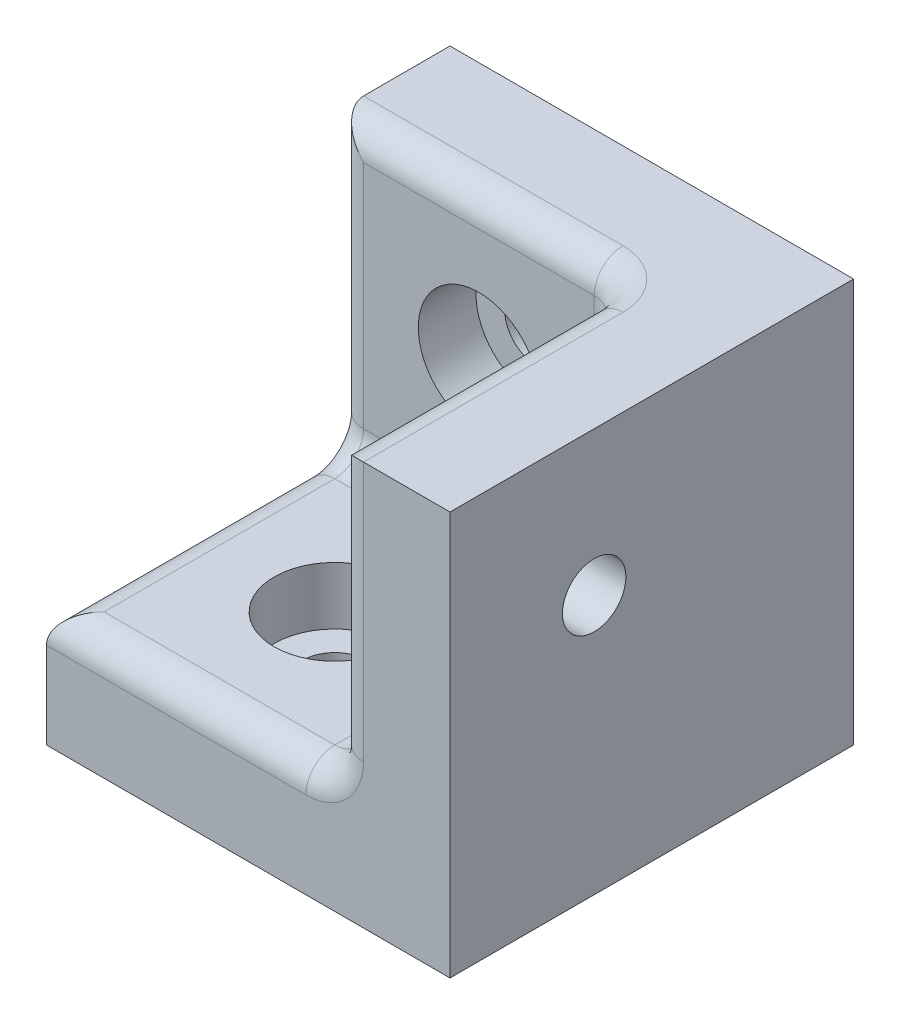
ISO-10303-21;
HEADER;
FILE_DESCRIPTION(('STEP AP214'),'2;1');
FILE_NAME('part.step','',(''),(''),'','','');
FILE_SCHEMA(('AUTOMOTIVE_DESIGN { 1 0 10303 214 1 1 1 1 }'));
ENDSEC;
DATA;
#1=APPLICATION_CONTEXT('core data for automotive mechanical design processes');
#2=APPLICATION_PROTOCOL_DEFINITION('international standard','automotive_design',2000,#1);
#3=PRODUCT_CONTEXT('',#1,'mechanical');
#4=PRODUCT('Part','Part','',(#3));
#5=PRODUCT_RELATED_PRODUCT_CATEGORY('part','',(#4));
#6=PRODUCT_DEFINITION_FORMATION('','',#4);
#7=PRODUCT_DEFINITION_CONTEXT('part definition',#1,'design');
#8=PRODUCT_DEFINITION('design','',#6,#7);
#9=PRODUCT_DEFINITION_SHAPE('','',#8);
#10=(LENGTH_UNIT() NAMED_UNIT(*) SI_UNIT(.MILLI.,.METRE.));
#11=(NAMED_UNIT(*) PLANE_ANGLE_UNIT() SI_UNIT($,.RADIAN.));
#12=(NAMED_UNIT(*) SI_UNIT($,.STERADIAN.) SOLID_ANGLE_UNIT());
#13=UNCERTAINTY_MEASURE_WITH_UNIT(LENGTH_MEASURE(1.E-05),#10,'distance_accuracy_value','');
#14=(GEOMETRIC_REPRESENTATION_CONTEXT(3) GLOBAL_UNCERTAINTY_ASSIGNED_CONTEXT((#13)) GLOBAL_UNIT_ASSIGNED_CONTEXT((#10,
#11,#12)) REPRESENTATION_CONTEXT('',''));
#15=CARTESIAN_POINT('',(0.,0.,0.));
#16=DIRECTION('',(0.,0.,1.));
#17=DIRECTION('',(1.,0.,0.));
#18=AXIS2_PLACEMENT_3D('',#15,#16,#17);
#19=CARTESIAN_POINT('',(9.,9.,9.));
#20=DIRECTION('',(-1.,0.,0.));
#21=DIRECTION('',(0.,0.,1.));
#22=AXIS2_PLACEMENT_3D('',#19,#20,#21);
#23=CYLINDRICAL_SURFACE('',#22,1.1);
#24=CARTESIAN_POINT('',(9.,9.,9.));
#25=DIRECTION('',(-1.,0.,0.));
#26=DIRECTION('',(0.,0.,1.));
#27=AXIS2_PLACEMENT_3D('',#24,#25,#26);
#28=CIRCLE('',#27,1.1);
#29=CARTESIAN_POINT('',(9.,9.,10.1));
#30=VERTEX_POINT('',#29);
#31=EDGE_CURVE('E164',#30,#30,#28,.T.);
#32=ORIENTED_EDGE('',*,*,#31,.F.);
#33=EDGE_LOOP('',(#32));
#34=FACE_BOUND('',#33,.T.);
#35=CARTESIAN_POINT('',(7.,9.,9.));
#36=DIRECTION('',(-1.,0.,0.));
#37=DIRECTION('',(0.,0.,1.));
#38=AXIS2_PLACEMENT_3D('',#35,#36,#37);
#39=CIRCLE('',#38,1.1);
#40=CARTESIAN_POINT('',(7.,9.,10.1));
#41=VERTEX_POINT('',#40);
#42=EDGE_CURVE('E167',#41,#41,#39,.F.);
#43=ORIENTED_EDGE('',*,*,#42,.F.);
#44=EDGE_LOOP('',(#43));
#45=FACE_BOUND('',#44,.T.);
#46=ADVANCED_FACE('F37',(#34,#45),#23,.F.);
#47=CARTESIAN_POINT('',(0.,0.,9.));
#48=DIRECTION('',(0.,1.,0.));
#49=DIRECTION('',(0.,0.,1.));
#50=AXIS2_PLACEMENT_3D('',#47,#48,#49);
#51=CYLINDRICAL_SURFACE('',#50,1.1);
#52=CARTESIAN_POINT('',(0.,0.,9.));
#53=DIRECTION('',(0.,1.,0.));
#54=DIRECTION('',(0.,0.,1.));
#55=AXIS2_PLACEMENT_3D('',#52,#53,#54);
#56=CIRCLE('',#55,1.1);
#57=CARTESIAN_POINT('',(0.,0.,10.1));
#58=VERTEX_POINT('',#57);
#59=EDGE_CURVE('E190',#58,#58,#56,.T.);
#60=ORIENTED_EDGE('',*,*,#59,.F.);
#61=EDGE_LOOP('',(#60));
#62=FACE_BOUND('',#61,.T.);
#63=CARTESIAN_POINT('',(0.,2.,9.));
#64=DIRECTION('',(0.,1.,0.));
#65=DIRECTION('',(0.,0.,1.));
#66=AXIS2_PLACEMENT_3D('',#63,#64,#65);
#67=CIRCLE('',#66,1.1);
#68=CARTESIAN_POINT('',(0.,2.,10.1));
#69=VERTEX_POINT('',#68);
#70=EDGE_CURVE('E180',#69,#69,#67,.F.);
#71=ORIENTED_EDGE('',*,*,#70,.F.);
#72=EDGE_LOOP('',(#71));
#73=FACE_BOUND('',#72,.T.);
#74=ADVANCED_FACE('F324',(#62,#73),#51,.F.);
#75=CARTESIAN_POINT('',(0.,9.,0.));
#76=DIRECTION('',(0.,0.,1.));
#77=DIRECTION('',(1.,0.,0.));
#78=AXIS2_PLACEMENT_3D('',#75,#76,#77);
#79=CYLINDRICAL_SURFACE('',#78,1.1);
#80=CARTESIAN_POINT('',(0.,9.,0.));
#81=DIRECTION('',(0.,0.,1.));
#82=DIRECTION('',(1.,0.,0.));
#83=AXIS2_PLACEMENT_3D('',#80,#81,#82);
#84=CIRCLE('',#83,1.1);
#85=CARTESIAN_POINT('',(1.1,9.,0.));
#86=VERTEX_POINT('',#85);
#87=EDGE_CURVE('E193',#86,#86,#84,.T.);
#88=ORIENTED_EDGE('',*,*,#87,.F.);
#89=EDGE_LOOP('',(#88));
#90=FACE_BOUND('',#89,.T.);
#91=CARTESIAN_POINT('',(0.,9.,2.));
#92=DIRECTION('',(0.,0.,1.));
#93=DIRECTION('',(1.,0.,0.));
#94=AXIS2_PLACEMENT_3D('',#91,#92,#93);
#95=CIRCLE('',#94,1.1);
#96=CARTESIAN_POINT('',(1.1,9.,2.));
#97=VERTEX_POINT('',#96);
#98=EDGE_CURVE('E186',#97,#97,#95,.F.);
#99=ORIENTED_EDGE('',*,*,#98,.F.);
#100=EDGE_LOOP('',(#99));
#101=FACE_BOUND('',#100,.T.);
#102=ADVANCED_FACE('F329',(#90,#101),#79,.F.);
#103=CARTESIAN_POINT('',(-5.,14.,4.));
#104=DIRECTION('',(1.,0.,0.));
#105=DIRECTION('',(0.,1.,0.));
#106=AXIS2_PLACEMENT_3D('',#103,#104,#105);
#107=PLANE('',#106);
#108=CARTESIAN_POINT('',(-5.,5.,5.));
#109=DIRECTION('',(1.,0.,0.));
#110=DIRECTION('',(0.,1.,0.));
#111=AXIS2_PLACEMENT_3D('',#108,#109,#110);
#112=CIRCLE('',#111,2.);
#113=CARTESIAN_POINT('',(-5.,5.,3.));
#114=VERTEX_POINT('',#113);
#115=CARTESIAN_POINT('',(-5.,3.,5.));
#116=VERTEX_POINT('',#115);
#117=EDGE_CURVE('E245',#114,#116,#112,.F.);
#118=ORIENTED_EDGE('',*,*,#117,.F.);
#119=DIRECTION('',(0.,-1.,0.));
#120=VECTOR('',#119,1.);
#121=CARTESIAN_POINT('',(-5.,14.,3.));
#122=LINE('',#121,#120);
#123=CARTESIAN_POINT('',(-5.,14.,3.));
#124=VERTEX_POINT('',#123);
#125=EDGE_CURVE('E250',#114,#124,#122,.F.);
#126=ORIENTED_EDGE('',*,*,#125,.T.);
#127=DIRECTION('',(0.,0.,-1.));
#128=VECTOR('',#127,1.);
#129=CARTESIAN_POINT('',(-5.,14.,4.));
#130=LINE('',#129,#128);
#131=CARTESIAN_POINT('',(-5.,14.,0.));
#132=VERTEX_POINT('',#131);
#133=EDGE_CURVE('E202',#124,#132,#130,.T.);
#134=ORIENTED_EDGE('',*,*,#133,.T.);
#135=DIRECTION('',(0.,-1.,0.));
#136=VECTOR('',#135,1.);
#137=CARTESIAN_POINT('',(-5.,14.,0.));
#138=LINE('',#137,#136);
#139=CARTESIAN_POINT('',(-5.,0.,0.));
#140=VERTEX_POINT('',#139);
#141=EDGE_CURVE('E150',#132,#140,#138,.T.);
#142=ORIENTED_EDGE('',*,*,#141,.T.);
#143=DIRECTION('',(0.,0.,-1.));
#144=VECTOR('',#143,1.);
#145=CARTESIAN_POINT('',(-5.,0.,4.));
#146=LINE('',#145,#144);
#147=CARTESIAN_POINT('',(-5.,0.,14.));
#148=VERTEX_POINT('',#147);
#149=EDGE_CURVE('E145',#148,#140,#146,.T.);
#150=ORIENTED_EDGE('',*,*,#149,.F.);
#151=DIRECTION('',(0.,-1.,0.));
#152=VECTOR('',#151,1.);
#153=CARTESIAN_POINT('',(-5.,0.,14.));
#154=LINE('',#153,#152);
#155=CARTESIAN_POINT('',(-5.,3.,14.));
#156=VERTEX_POINT('',#155);
#157=EDGE_CURVE('E196',#156,#148,#154,.T.);
#158=ORIENTED_EDGE('',*,*,#157,.F.);
#159=DIRECTION('',(0.,0.,-1.));
#160=VECTOR('',#159,1.);
#161=CARTESIAN_POINT('',(-5.,3.,4.));
#162=LINE('',#161,#160);
#163=EDGE_CURVE('E248',#156,#116,#162,.T.);
#164=ORIENTED_EDGE('',*,*,#163,.T.);
#165=EDGE_LOOP('',(#118,#126,#134,#142,#150,#158,#164));
#166=FACE_BOUND('',#165,.T.);
#167=ADVANCED_FACE('F360',(#166),#107,.F.);
#168=CARTESIAN_POINT('',(-5.,0.,4.));
#169=DIRECTION('',(0.,1.,0.));
#170=DIRECTION('',(0.,0.,1.));
#171=AXIS2_PLACEMENT_3D('',#168,#169,#170);
#172=PLANE('',#171);
#173=ORIENTED_EDGE('',*,*,#59,.T.);
#174=EDGE_LOOP('',(#173));
#175=FACE_BOUND('',#174,.T.);
#176=DIRECTION('',(1.,0.,0.));
#177=VECTOR('',#176,1.);
#178=CARTESIAN_POINT('',(-5.,0.,0.));
#179=LINE('',#178,#177);
#180=CARTESIAN_POINT('',(9.,0.,0.));
#181=VERTEX_POINT('',#180);
#182=EDGE_CURVE('E138',#140,#181,#179,.T.);
#183=ORIENTED_EDGE('',*,*,#182,.T.);
#184=DIRECTION('',(0.,0.,-1.));
#185=VECTOR('',#184,1.);
#186=CARTESIAN_POINT('',(9.,0.,14.));
#187=LINE('',#186,#185);
#188=CARTESIAN_POINT('',(9.,0.,14.));
#189=VERTEX_POINT('',#188);
#190=EDGE_CURVE('E143',#189,#181,#187,.T.);
#191=ORIENTED_EDGE('',*,*,#190,.F.);
#192=DIRECTION('',(1.,0.,0.));
#193=VECTOR('',#192,1.);
#194=CARTESIAN_POINT('',(-5.,0.,14.));
#195=LINE('',#194,#193);
#196=EDGE_CURVE('E198',#148,#189,#195,.T.);
#197=ORIENTED_EDGE('',*,*,#196,.F.);
#198=ORIENTED_EDGE('',*,*,#149,.T.);
#199=EDGE_LOOP('',(#183,#191,#197,#198));
#200=FACE_BOUND('',#199,.T.);
#201=ADVANCED_FACE('F140',(#175,#200),#172,.F.);
#202=CARTESIAN_POINT('',(-5.,14.,4.));
#203=DIRECTION('',(0.,-1.,0.));
#204=DIRECTION('',(0.,0.,-1.));
#205=AXIS2_PLACEMENT_3D('',#202,#203,#204);
#206=PLANE('',#205);
#207=CARTESIAN_POINT('',(4.,14.,5.));
#208=DIRECTION('',(0.,-1.,0.));
#209=DIRECTION('',(0.,0.,-1.));
#210=AXIS2_PLACEMENT_3D('',#207,#208,#209);
#211=CIRCLE('',#210,2.);
#212=CARTESIAN_POINT('',(6.,14.,5.));
#213=VERTEX_POINT('',#212);
#214=CARTESIAN_POINT('',(4.,14.,3.));
#215=VERTEX_POINT('',#214);
#216=EDGE_CURVE('E205',#213,#215,#211,.F.);
#217=ORIENTED_EDGE('',*,*,#216,.F.);
#218=DIRECTION('',(0.,0.,1.));
#219=VECTOR('',#218,1.);
#220=CARTESIAN_POINT('',(6.,14.,4.));
#221=LINE('',#220,#219);
#222=CARTESIAN_POINT('',(6.,14.,14.));
#223=VERTEX_POINT('',#222);
#224=EDGE_CURVE('E217',#213,#223,#221,.T.);
#225=ORIENTED_EDGE('',*,*,#224,.T.);
#226=DIRECTION('',(-1.,0.,0.));
#227=VECTOR('',#226,1.);
#228=CARTESIAN_POINT('',(9.,14.,14.));
#229=LINE('',#228,#227);
#230=CARTESIAN_POINT('',(9.,14.,14.));
#231=VERTEX_POINT('',#230);
#232=EDGE_CURVE('E173',#231,#223,#229,.T.);
#233=ORIENTED_EDGE('',*,*,#232,.F.);
#234=DIRECTION('',(0.,0.,1.));
#235=VECTOR('',#234,1.);
#236=CARTESIAN_POINT('',(9.,14.,0.));
#237=LINE('',#236,#235);
#238=CARTESIAN_POINT('',(9.,14.,0.));
#239=VERTEX_POINT('',#238);
#240=EDGE_CURVE('E158',#239,#231,#237,.T.);
#241=ORIENTED_EDGE('',*,*,#240,.F.);
#242=DIRECTION('',(-1.,0.,0.));
#243=VECTOR('',#242,1.);
#244=CARTESIAN_POINT('',(-5.,14.,0.));
#245=LINE('',#244,#243);
#246=EDGE_CURVE('E149',#239,#132,#245,.T.);
#247=ORIENTED_EDGE('',*,*,#246,.T.);
#248=ORIENTED_EDGE('',*,*,#133,.F.);
#249=DIRECTION('',(-1.,0.,0.));
#250=VECTOR('',#249,1.);
#251=CARTESIAN_POINT('',(5.,14.,3.));
#252=LINE('',#251,#250);
#253=EDGE_CURVE('E215',#124,#215,#252,.F.);
#254=ORIENTED_EDGE('',*,*,#253,.T.);
#255=EDGE_LOOP('',(#217,#225,#233,#241,#247,#248,#254));
#256=FACE_BOUND('',#255,.T.);
#257=ADVANCED_FACE('F371',(#256),#206,.F.);
#258=CARTESIAN_POINT('',(0.,0.,4.));
#259=DIRECTION('',(0.,0.,1.));
#260=DIRECTION('',(1.,0.,0.));
#261=AXIS2_PLACEMENT_3D('',#258,#259,#260);
#262=PLANE('',#261);
#263=DIRECTION('',(0.,1.,0.));
#264=VECTOR('',#263,1.);
#265=CARTESIAN_POINT('',(4.,0.,4.));
#266=LINE('',#265,#264);
#267=CARTESIAN_POINT('',(4.,5.,4.));
#268=VERTEX_POINT('',#267);
#269=CARTESIAN_POINT('',(4.,13.,4.));
#270=VERTEX_POINT('',#269);
#271=EDGE_CURVE('E238',#268,#270,#266,.T.);
#272=ORIENTED_EDGE('',*,*,#271,.T.);
#273=DIRECTION('',(-1.,0.,0.));
#274=VECTOR('',#273,1.);
#275=CARTESIAN_POINT('',(-5.,13.,4.));
#276=LINE('',#275,#274);
#277=CARTESIAN_POINT('',(-4.,13.,4.));
#278=VERTEX_POINT('',#277);
#279=EDGE_CURVE('E243',#270,#278,#276,.T.);
#280=ORIENTED_EDGE('',*,*,#279,.T.);
#281=DIRECTION('',(0.,-1.,0.));
#282=VECTOR('',#281,1.);
#283=CARTESIAN_POINT('',(-4.,4.,4.));
#284=LINE('',#283,#282);
#285=CARTESIAN_POINT('',(-4.,5.,4.));
#286=VERTEX_POINT('',#285);
#287=EDGE_CURVE('E240',#278,#286,#284,.T.);
#288=ORIENTED_EDGE('',*,*,#287,.T.);
#289=DIRECTION('',(-1.,0.,0.));
#290=VECTOR('',#289,1.);
#291=CARTESIAN_POINT('',(0.,5.,4.));
#292=LINE('',#291,#290);
#293=EDGE_CURVE('E236',#286,#268,#292,.F.);
#294=ORIENTED_EDGE('',*,*,#293,.T.);
#295=EDGE_LOOP('',(#272,#280,#288,#294));
#296=FACE_BOUND('',#295,.T.);
#297=CARTESIAN_POINT('',(0.,9.,4.));
#298=DIRECTION('',(0.,0.,1.));
#299=DIRECTION('',(1.,0.,0.));
#300=AXIS2_PLACEMENT_3D('',#297,#298,#299);
#301=CIRCLE('',#300,2.1);
#302=CARTESIAN_POINT('',(2.1,9.,4.));
#303=VERTEX_POINT('',#302);
#304=EDGE_CURVE('E187',#303,#303,#301,.T.);
#305=ORIENTED_EDGE('',*,*,#304,.F.);
#306=EDGE_LOOP('',(#305));
#307=FACE_BOUND('',#306,.T.);
#308=ADVANCED_FACE('F368',(#296,#307),#262,.T.);
#309=CARTESIAN_POINT('',(0.,0.,0.));
#310=DIRECTION('',(0.,0.,1.));
#311=DIRECTION('',(1.,0.,0.));
#312=AXIS2_PLACEMENT_3D('',#309,#310,#311);
#313=PLANE('',#312);
#314=ORIENTED_EDGE('',*,*,#87,.T.);
#315=EDGE_LOOP('',(#314));
#316=FACE_BOUND('',#315,.T.);
#317=ORIENTED_EDGE('',*,*,#141,.F.);
#318=ORIENTED_EDGE('',*,*,#246,.F.);
#319=DIRECTION('',(0.,1.,0.));
#320=VECTOR('',#319,1.);
#321=CARTESIAN_POINT('',(9.,0.,0.));
#322=LINE('',#321,#320);
#323=EDGE_CURVE('E153',#181,#239,#322,.T.);
#324=ORIENTED_EDGE('',*,*,#323,.F.);
#325=ORIENTED_EDGE('',*,*,#182,.F.);
#326=EDGE_LOOP('',(#317,#318,#324,#325));
#327=FACE_BOUND('',#326,.T.);
#328=ADVANCED_FACE('F154',(#316,#327),#313,.F.);
#329=CARTESIAN_POINT('',(-5.,4.,14.));
#330=DIRECTION('',(0.,-1.,0.));
#331=DIRECTION('',(0.,0.,-1.));
#332=AXIS2_PLACEMENT_3D('',#329,#330,#331);
#333=PLANE('',#332);
#334=DIRECTION('',(-1.,0.,0.));
#335=VECTOR('',#334,1.);
#336=CARTESIAN_POINT('',(-5.,4.,13.));
#337=LINE('',#336,#335);
#338=CARTESIAN_POINT('',(-4.,4.,13.));
#339=VERTEX_POINT('',#338);
#340=CARTESIAN_POINT('',(4.,4.,13.));
#341=VERTEX_POINT('',#340);
#342=EDGE_CURVE('E46',#339,#341,#337,.F.);
#343=ORIENTED_EDGE('',*,*,#342,.T.);
#344=DIRECTION('',(0.,0.,-1.));
#345=VECTOR('',#344,1.);
#346=CARTESIAN_POINT('',(4.,4.,4.));
#347=LINE('',#346,#345);
#348=CARTESIAN_POINT('',(4.,4.,5.));
#349=VERTEX_POINT('',#348);
#350=EDGE_CURVE('E11',#341,#349,#347,.T.);
#351=ORIENTED_EDGE('',*,*,#350,.T.);
#352=DIRECTION('',(-1.,0.,0.));
#353=VECTOR('',#352,1.);
#354=CARTESIAN_POINT('',(-5.,4.,5.));
#355=LINE('',#354,#353);
#356=CARTESIAN_POINT('',(-4.,4.,5.));
#357=VERTEX_POINT('',#356);
#358=EDGE_CURVE('E252',#349,#357,#355,.T.);
#359=ORIENTED_EDGE('',*,*,#358,.T.);
#360=DIRECTION('',(0.,0.,-1.));
#361=VECTOR('',#360,1.);
#362=CARTESIAN_POINT('',(-4.,4.,14.));
#363=LINE('',#362,#361);
#364=EDGE_CURVE('E57',#357,#339,#363,.F.);
#365=ORIENTED_EDGE('',*,*,#364,.T.);
#366=EDGE_LOOP('',(#343,#351,#359,#365));
#367=FACE_BOUND('',#366,.T.);
#368=CARTESIAN_POINT('',(0.,4.,9.));
#369=DIRECTION('',(0.,1.,0.));
#370=DIRECTION('',(0.,0.,1.));
#371=AXIS2_PLACEMENT_3D('',#368,#369,#370);
#372=CIRCLE('',#371,2.1);
#373=CARTESIAN_POINT('',(0.,4.,11.1));
#374=VERTEX_POINT('',#373);
#375=EDGE_CURVE('E176',#374,#374,#372,.T.);
#376=ORIENTED_EDGE('',*,*,#375,.F.);
#377=EDGE_LOOP('',(#376));
#378=FACE_BOUND('',#377,.T.);
#379=ADVANCED_FACE('F364',(#367,#378),#333,.F.);
#380=CARTESIAN_POINT('',(0.,0.,14.));
#381=DIRECTION('',(0.,0.,-1.));
#382=DIRECTION('',(-1.,0.,0.));
#383=AXIS2_PLACEMENT_3D('',#380,#381,#382);
#384=PLANE('',#383);
#385=ORIENTED_EDGE('',*,*,#232,.T.);
#386=DIRECTION('',(0.,-1.,0.));
#387=VECTOR('',#386,1.);
#388=CARTESIAN_POINT('',(6.,0.,14.));
#389=LINE('',#388,#387);
#390=CARTESIAN_POINT('',(6.,5.,14.));
#391=VERTEX_POINT('',#390);
#392=EDGE_CURVE('E234',#223,#391,#389,.T.);
#393=ORIENTED_EDGE('',*,*,#392,.T.);
#394=CARTESIAN_POINT('',(4.,5.,14.));
#395=DIRECTION('',(0.,0.,-1.));
#396=DIRECTION('',(-1.,0.,0.));
#397=AXIS2_PLACEMENT_3D('',#394,#395,#396);
#398=CIRCLE('',#397,2.);
#399=CARTESIAN_POINT('',(4.,3.,14.));
#400=VERTEX_POINT('',#399);
#401=EDGE_CURVE('E231',#400,#391,#398,.F.);
#402=ORIENTED_EDGE('',*,*,#401,.F.);
#403=DIRECTION('',(-1.,0.,0.));
#404=VECTOR('',#403,1.);
#405=CARTESIAN_POINT('',(0.,3.,14.));
#406=LINE('',#405,#404);
#407=EDGE_CURVE('E229',#400,#156,#406,.T.);
#408=ORIENTED_EDGE('',*,*,#407,.T.);
#409=ORIENTED_EDGE('',*,*,#157,.T.);
#410=ORIENTED_EDGE('',*,*,#196,.T.);
#411=DIRECTION('',(0.,-1.,0.));
#412=VECTOR('',#411,1.);
#413=CARTESIAN_POINT('',(9.,0.,14.));
#414=LINE('',#413,#412);
#415=EDGE_CURVE('E163',#231,#189,#414,.T.);
#416=ORIENTED_EDGE('',*,*,#415,.F.);
#417=EDGE_LOOP('',(#385,#393,#402,#408,#409,#410,#416));
#418=FACE_BOUND('',#417,.T.);
#419=ADVANCED_FACE('F353',(#418),#384,.F.);
#420=CARTESIAN_POINT('',(0.,9.,2.));
#421=DIRECTION('',(0.,0.,1.));
#422=DIRECTION('',(1.,0.,0.));
#423=AXIS2_PLACEMENT_3D('',#420,#421,#422);
#424=PLANE('',#423);
#425=CARTESIAN_POINT('',(0.,9.,2.));
#426=DIRECTION('',(0.,0.,1.));
#427=DIRECTION('',(1.,0.,0.));
#428=AXIS2_PLACEMENT_3D('',#425,#426,#427);
#429=CIRCLE('',#428,2.1);
#430=CARTESIAN_POINT('',(2.1,9.,2.));
#431=VERTEX_POINT('',#430);
#432=EDGE_CURVE('E183',#431,#431,#429,.T.);
#433=ORIENTED_EDGE('',*,*,#432,.T.);
#434=EDGE_LOOP('',(#433));
#435=FACE_BOUND('',#434,.T.);
#436=ORIENTED_EDGE('',*,*,#98,.T.);
#437=EDGE_LOOP('',(#436));
#438=FACE_BOUND('',#437,.T.);
#439=ADVANCED_FACE('F350',(#435,#438),#424,.T.);
#440=CARTESIAN_POINT('',(0.,9.,2.));
#441=DIRECTION('',(0.,0.,1.));
#442=DIRECTION('',(1.,0.,0.));
#443=AXIS2_PLACEMENT_3D('',#440,#441,#442);
#444=CYLINDRICAL_SURFACE('',#443,2.1);
#445=ORIENTED_EDGE('',*,*,#432,.F.);
#446=EDGE_LOOP('',(#445));
#447=FACE_BOUND('',#446,.T.);
#448=ORIENTED_EDGE('',*,*,#304,.T.);
#449=EDGE_LOOP('',(#448));
#450=FACE_BOUND('',#449,.T.);
#451=ADVANCED_FACE('F345',(#447,#450),#444,.F.);
#452=CARTESIAN_POINT('',(0.,2.,9.));
#453=DIRECTION('',(0.,1.,0.));
#454=DIRECTION('',(0.,0.,1.));
#455=AXIS2_PLACEMENT_3D('',#452,#453,#454);
#456=PLANE('',#455);
#457=CARTESIAN_POINT('',(0.,2.,9.));
#458=DIRECTION('',(0.,1.,0.));
#459=DIRECTION('',(0.,0.,1.));
#460=AXIS2_PLACEMENT_3D('',#457,#458,#459);
#461=CIRCLE('',#460,2.1);
#462=CARTESIAN_POINT('',(0.,2.,11.1));
#463=VERTEX_POINT('',#462);
#464=EDGE_CURVE('E177',#463,#463,#461,.T.);
#465=ORIENTED_EDGE('',*,*,#464,.T.);
#466=EDGE_LOOP('',(#465));
#467=FACE_BOUND('',#466,.T.);
#468=ORIENTED_EDGE('',*,*,#70,.T.);
#469=EDGE_LOOP('',(#468));
#470=FACE_BOUND('',#469,.T.);
#471=ADVANCED_FACE('F342',(#467,#470),#456,.T.);
#472=CARTESIAN_POINT('',(0.,2.,9.));
#473=DIRECTION('',(0.,1.,0.));
#474=DIRECTION('',(0.,0.,1.));
#475=AXIS2_PLACEMENT_3D('',#472,#473,#474);
#476=CYLINDRICAL_SURFACE('',#475,2.1);
#477=ORIENTED_EDGE('',*,*,#464,.F.);
#478=EDGE_LOOP('',(#477));
#479=FACE_BOUND('',#478,.T.);
#480=ORIENTED_EDGE('',*,*,#375,.T.);
#481=EDGE_LOOP('',(#480));
#482=FACE_BOUND('',#481,.T.);
#483=ADVANCED_FACE('F337',(#479,#482),#476,.F.);
#484=CARTESIAN_POINT('',(9.,0.,0.));
#485=DIRECTION('',(1.,0.,0.));
#486=DIRECTION('',(0.,0.,-1.));
#487=AXIS2_PLACEMENT_3D('',#484,#485,#486);
#488=PLANE('',#487);
#489=ORIENTED_EDGE('',*,*,#31,.T.);
#490=EDGE_LOOP('',(#489));
#491=FACE_BOUND('',#490,.T.);
#492=ORIENTED_EDGE('',*,*,#190,.T.);
#493=ORIENTED_EDGE('',*,*,#323,.T.);
#494=ORIENTED_EDGE('',*,*,#240,.T.);
#495=ORIENTED_EDGE('',*,*,#415,.T.);
#496=EDGE_LOOP('',(#492,#493,#494,#495));
#497=FACE_BOUND('',#496,.T.);
#498=ADVANCED_FACE('F161',(#491,#497),#488,.T.);
#499=CARTESIAN_POINT('',(5.,0.,0.));
#500=DIRECTION('',(1.,0.,0.));
#501=DIRECTION('',(0.,0.,-1.));
#502=AXIS2_PLACEMENT_3D('',#499,#500,#501);
#503=PLANE('',#502);
#504=DIRECTION('',(0.,-1.,0.));
#505=VECTOR('',#504,1.);
#506=CARTESIAN_POINT('',(5.,0.,13.));
#507=LINE('',#506,#505);
#508=CARTESIAN_POINT('',(5.,5.,13.));
#509=VERTEX_POINT('',#508);
#510=CARTESIAN_POINT('',(5.,13.,13.));
#511=VERTEX_POINT('',#510);
#512=EDGE_CURVE('E224',#509,#511,#507,.F.);
#513=ORIENTED_EDGE('',*,*,#512,.T.);
#514=DIRECTION('',(0.,0.,1.));
#515=VECTOR('',#514,1.);
#516=CARTESIAN_POINT('',(5.,13.,0.));
#517=LINE('',#516,#515);
#518=CARTESIAN_POINT('',(5.,13.,5.));
#519=VERTEX_POINT('',#518);
#520=EDGE_CURVE('E226',#511,#519,#517,.F.);
#521=ORIENTED_EDGE('',*,*,#520,.T.);
#522=DIRECTION('',(0.,1.,0.));
#523=VECTOR('',#522,1.);
#524=CARTESIAN_POINT('',(5.,0.,5.));
#525=LINE('',#524,#523);
#526=CARTESIAN_POINT('',(5.,5.,5.));
#527=VERTEX_POINT('',#526);
#528=EDGE_CURVE('E222',#519,#527,#525,.F.);
#529=ORIENTED_EDGE('',*,*,#528,.T.);
#530=DIRECTION('',(0.,0.,-1.));
#531=VECTOR('',#530,1.);
#532=CARTESIAN_POINT('',(5.,5.,14.));
#533=LINE('',#532,#531);
#534=EDGE_CURVE('E220',#527,#509,#533,.F.);
#535=ORIENTED_EDGE('',*,*,#534,.T.);
#536=EDGE_LOOP('',(#513,#521,#529,#535));
#537=FACE_BOUND('',#536,.T.);
#538=CARTESIAN_POINT('',(5.,9.,9.));
#539=DIRECTION('',(-1.,0.,0.));
#540=DIRECTION('',(0.,0.,1.));
#541=AXIS2_PLACEMENT_3D('',#538,#539,#540);
#542=CIRCLE('',#541,2.1);
#543=CARTESIAN_POINT('',(5.,9.,11.1));
#544=VERTEX_POINT('',#543);
#545=EDGE_CURVE('E296',#544,#544,#542,.T.);
#546=ORIENTED_EDGE('',*,*,#545,.F.);
#547=EDGE_LOOP('',(#546));
#548=FACE_BOUND('',#547,.T.);
#549=ADVANCED_FACE('F320',(#537,#548),#503,.F.);
#550=CARTESIAN_POINT('',(7.,9.,9.));
#551=DIRECTION('',(-1.,0.,0.));
#552=DIRECTION('',(0.,0.,1.));
#553=AXIS2_PLACEMENT_3D('',#550,#551,#552);
#554=PLANE('',#553);
#555=CARTESIAN_POINT('',(7.,9.,9.));
#556=DIRECTION('',(-1.,0.,0.));
#557=DIRECTION('',(0.,0.,1.));
#558=AXIS2_PLACEMENT_3D('',#555,#556,#557);
#559=CIRCLE('',#558,2.1);
#560=CARTESIAN_POINT('',(7.,9.,11.1));
#561=VERTEX_POINT('',#560);
#562=EDGE_CURVE('E212',#561,#561,#559,.T.);
#563=ORIENTED_EDGE('',*,*,#562,.T.);
#564=EDGE_LOOP('',(#563));
#565=FACE_BOUND('',#564,.T.);
#566=ORIENTED_EDGE('',*,*,#42,.T.);
#567=EDGE_LOOP('',(#566));
#568=FACE_BOUND('',#567,.T.);
#569=ADVANCED_FACE('F308',(#565,#568),#554,.T.);
#570=CARTESIAN_POINT('',(7.,9.,9.));
#571=DIRECTION('',(-1.,0.,0.));
#572=DIRECTION('',(0.,0.,1.));
#573=AXIS2_PLACEMENT_3D('',#570,#571,#572);
#574=CYLINDRICAL_SURFACE('',#573,2.1);
#575=ORIENTED_EDGE('',*,*,#562,.F.);
#576=EDGE_LOOP('',(#575));
#577=FACE_BOUND('',#576,.T.);
#578=ORIENTED_EDGE('',*,*,#545,.T.);
#579=EDGE_LOOP('',(#578));
#580=FACE_BOUND('',#579,.T.);
#581=ADVANCED_FACE('F311',(#577,#580),#574,.F.);
#582=CARTESIAN_POINT('',(-5.,5.,5.));
#583=DIRECTION('',(-1.,0.,0.));
#584=DIRECTION('',(0.,0.,1.));
#585=AXIS2_PLACEMENT_3D('',#582,#583,#584);
#586=CYLINDRICAL_SURFACE('',#585,1.);
#587=CARTESIAN_POINT('',(-4.,5.,5.));
#588=DIRECTION('',(1.,0.,0.));
#589=DIRECTION('',(0.,1.,0.));
#590=AXIS2_PLACEMENT_3D('',#587,#588,#589);
#591=CIRCLE('',#590,1.);
#592=EDGE_CURVE('E41',#357,#286,#591,.T.);
#593=ORIENTED_EDGE('',*,*,#592,.F.);
#594=ORIENTED_EDGE('',*,*,#358,.F.);
#595=CARTESIAN_POINT('',(4.,5.,5.));
#596=DIRECTION('',(-1.,0.,0.));
#597=DIRECTION('',(0.,0.,1.));
#598=AXIS2_PLACEMENT_3D('',#595,#596,#597);
#599=CIRCLE('',#598,1.);
#600=EDGE_CURVE('E288',#268,#349,#599,.T.);
#601=ORIENTED_EDGE('',*,*,#600,.F.);
#602=ORIENTED_EDGE('',*,*,#293,.F.);
#603=EDGE_LOOP('',(#593,#594,#601,#602));
#604=FACE_BOUND('',#603,.T.);
#605=ADVANCED_FACE('F39',(#604),#586,.F.);
#606=CARTESIAN_POINT('',(-4.,5.,5.));
#607=DIRECTION('',(1.,0.,0.));
#608=DIRECTION('',(0.,1.,0.));
#609=AXIS2_PLACEMENT_3D('',#606,#607,#608);
#610=TOROIDAL_SURFACE('',#609,2.,1.);
#611=CARTESIAN_POINT('',(-4.,5.,3.));
#612=DIRECTION('',(0.,-1.,0.));
#613=DIRECTION('',(0.,0.,-1.));
#614=AXIS2_PLACEMENT_3D('',#611,#612,#613);
#615=CIRCLE('',#614,1.);
#616=EDGE_CURVE('E286',#114,#286,#615,.F.);
#617=ORIENTED_EDGE('',*,*,#616,.F.);
#618=ORIENTED_EDGE('',*,*,#117,.T.);
#619=CARTESIAN_POINT('',(-4.,3.,5.));
#620=DIRECTION('',(0.,0.,-1.));
#621=DIRECTION('',(-1.,0.,0.));
#622=AXIS2_PLACEMENT_3D('',#619,#620,#621);
#623=CIRCLE('',#622,1.);
#624=EDGE_CURVE('E290',#357,#116,#623,.F.);
#625=ORIENTED_EDGE('',*,*,#624,.F.);
#626=ORIENTED_EDGE('',*,*,#592,.T.);
#627=EDGE_LOOP('',(#617,#618,#625,#626));
#628=FACE_BOUND('',#627,.T.);
#629=ADVANCED_FACE('F318',(#628),#610,.T.);
#630=CARTESIAN_POINT('',(-4.,3.,4.));
#631=DIRECTION('',(0.,0.,-1.));
#632=DIRECTION('',(-1.,0.,0.));
#633=AXIS2_PLACEMENT_3D('',#630,#631,#632);
#634=CYLINDRICAL_SURFACE('',#633,1.);
#635=ORIENTED_EDGE('',*,*,#624,.T.);
#636=ORIENTED_EDGE('',*,*,#163,.F.);
#637=CARTESIAN_POINT('',(-4.,3.,13.));
#638=DIRECTION('',(-0.707106781186547,0.,-0.707106781186547));
#639=DIRECTION('',(0.707106781186547,0.,-0.707106781186547));
#640=AXIS2_PLACEMENT_3D('',#637,#638,#639);
#641=ELLIPSE('',#640,1.41421356237309,1.);
#642=EDGE_CURVE('E283',#339,#156,#641,.F.);
#643=ORIENTED_EDGE('',*,*,#642,.F.);
#644=ORIENTED_EDGE('',*,*,#364,.F.);
#645=EDGE_LOOP('',(#635,#636,#643,#644));
#646=FACE_BOUND('',#645,.T.);
#647=ADVANCED_FACE('F424',(#646),#634,.T.);
#648=CARTESIAN_POINT('',(4.,5.,5.));
#649=DIRECTION('',(0.,0.,1.));
#650=DIRECTION('',(1.,0.,0.));
#651=AXIS2_PLACEMENT_3D('',#648,#649,#650);
#652=SPHERICAL_SURFACE('',#651,1.);
#653=CARTESIAN_POINT('',(4.,5.,5.));
#654=DIRECTION('',(0.,1.,0.));
#655=DIRECTION('',(0.,0.,1.));
#656=AXIS2_PLACEMENT_3D('',#653,#654,#655);
#657=CIRCLE('',#656,1.);
#658=EDGE_CURVE('E278',#268,#527,#657,.F.);
#659=ORIENTED_EDGE('',*,*,#658,.F.);
#660=ORIENTED_EDGE('',*,*,#600,.T.);
#661=CARTESIAN_POINT('',(4.,5.,5.));
#662=DIRECTION('',(0.,0.,1.));
#663=DIRECTION('',(1.,0.,0.));
#664=AXIS2_PLACEMENT_3D('',#661,#662,#663);
#665=CIRCLE('',#664,1.);
#666=EDGE_CURVE('E281',#527,#349,#665,.F.);
#667=ORIENTED_EDGE('',*,*,#666,.F.);
#668=EDGE_LOOP('',(#659,#660,#667));
#669=FACE_BOUND('',#668,.T.);
#670=ADVANCED_FACE('F420',(#669),#652,.F.);
#671=CARTESIAN_POINT('',(-4.,0.,3.));
#672=DIRECTION('',(0.,1.,0.));
#673=DIRECTION('',(-1.,0.,0.));
#674=AXIS2_PLACEMENT_3D('',#671,#672,#673);
#675=CYLINDRICAL_SURFACE('',#674,1.);
#676=ORIENTED_EDGE('',*,*,#616,.T.);
#677=ORIENTED_EDGE('',*,*,#287,.F.);
#678=CARTESIAN_POINT('',(-4.,13.,3.));
#679=DIRECTION('',(0.707106781186547,0.707106781186548,0.));
#680=DIRECTION('',(0.707106781186547,-0.707106781186547,0.));
#681=AXIS2_PLACEMENT_3D('',#678,#679,#680);
#682=ELLIPSE('',#681,1.4142135623731,1.);
#683=EDGE_CURVE('E275',#124,#278,#682,.T.);
#684=ORIENTED_EDGE('',*,*,#683,.F.);
#685=ORIENTED_EDGE('',*,*,#125,.F.);
#686=EDGE_LOOP('',(#676,#677,#684,#685));
#687=FACE_BOUND('',#686,.T.);
#688=ADVANCED_FACE('F416',(#687),#675,.T.);
#689=CARTESIAN_POINT('',(0.,3.,13.));
#690=DIRECTION('',(-1.,0.,0.));
#691=DIRECTION('',(0.,0.,1.));
#692=AXIS2_PLACEMENT_3D('',#689,#690,#691);
#693=CYLINDRICAL_SURFACE('',#692,1.);
#694=ORIENTED_EDGE('',*,*,#642,.T.);
#695=ORIENTED_EDGE('',*,*,#407,.F.);
#696=CARTESIAN_POINT('',(4.,3.,13.));
#697=DIRECTION('',(1.,0.,0.));
#698=DIRECTION('',(0.,0.,-1.));
#699=AXIS2_PLACEMENT_3D('',#696,#697,#698);
#700=CIRCLE('',#699,1.);
#701=EDGE_CURVE('E272',#341,#400,#700,.T.);
#702=ORIENTED_EDGE('',*,*,#701,.F.);
#703=ORIENTED_EDGE('',*,*,#342,.F.);
#704=EDGE_LOOP('',(#694,#695,#702,#703));
#705=FACE_BOUND('',#704,.T.);
#706=ADVANCED_FACE('F412',(#705),#693,.T.);
#707=CARTESIAN_POINT('',(4.,5.,14.));
#708=DIRECTION('',(0.,0.,1.));
#709=DIRECTION('',(1.,0.,0.));
#710=AXIS2_PLACEMENT_3D('',#707,#708,#709);
#711=CYLINDRICAL_SURFACE('',#710,1.);
#712=ORIENTED_EDGE('',*,*,#666,.T.);
#713=ORIENTED_EDGE('',*,*,#350,.F.);
#714=CARTESIAN_POINT('',(4.,5.,13.));
#715=DIRECTION('',(0.,0.,-1.));
#716=DIRECTION('',(-1.,0.,0.));
#717=AXIS2_PLACEMENT_3D('',#714,#715,#716);
#718=CIRCLE('',#717,1.);
#719=EDGE_CURVE('E269',#509,#341,#718,.T.);
#720=ORIENTED_EDGE('',*,*,#719,.F.);
#721=ORIENTED_EDGE('',*,*,#534,.F.);
#722=EDGE_LOOP('',(#712,#713,#720,#721));
#723=FACE_BOUND('',#722,.T.);
#724=ADVANCED_FACE('F408',(#723),#711,.F.);
#725=CARTESIAN_POINT('',(4.,0.,5.));
#726=DIRECTION('',(0.,1.,0.));
#727=DIRECTION('',(0.,0.,1.));
#728=AXIS2_PLACEMENT_3D('',#725,#726,#727);
#729=CYLINDRICAL_SURFACE('',#728,1.);
#730=ORIENTED_EDGE('',*,*,#658,.T.);
#731=ORIENTED_EDGE('',*,*,#528,.F.);
#732=CARTESIAN_POINT('',(4.,13.,5.));
#733=DIRECTION('',(0.,-1.,0.));
#734=DIRECTION('',(0.,0.,-1.));
#735=AXIS2_PLACEMENT_3D('',#732,#733,#734);
#736=CIRCLE('',#735,1.);
#737=EDGE_CURVE('E266',#270,#519,#736,.T.);
#738=ORIENTED_EDGE('',*,*,#737,.F.);
#739=ORIENTED_EDGE('',*,*,#271,.F.);
#740=EDGE_LOOP('',(#730,#731,#738,#739));
#741=FACE_BOUND('',#740,.T.);
#742=ADVANCED_FACE('F404',(#741),#729,.F.);
#743=CARTESIAN_POINT('',(0.,13.,3.));
#744=DIRECTION('',(1.,0.,0.));
#745=DIRECTION('',(0.,0.,-1.));
#746=AXIS2_PLACEMENT_3D('',#743,#744,#745);
#747=CYLINDRICAL_SURFACE('',#746,1.);
#748=ORIENTED_EDGE('',*,*,#683,.T.);
#749=ORIENTED_EDGE('',*,*,#279,.F.);
#750=CARTESIAN_POINT('',(4.,13.,3.));
#751=DIRECTION('',(1.,0.,0.));
#752=DIRECTION('',(0.,0.,-1.));
#753=AXIS2_PLACEMENT_3D('',#750,#751,#752);
#754=CIRCLE('',#753,1.);
#755=EDGE_CURVE('E263',#215,#270,#754,.T.);
#756=ORIENTED_EDGE('',*,*,#755,.F.);
#757=ORIENTED_EDGE('',*,*,#253,.F.);
#758=EDGE_LOOP('',(#748,#749,#756,#757));
#759=FACE_BOUND('',#758,.T.);
#760=ADVANCED_FACE('F400',(#759),#747,.T.);
#761=CARTESIAN_POINT('',(4.,5.,13.));
#762=DIRECTION('',(0.,0.,-1.));
#763=DIRECTION('',(-1.,0.,0.));
#764=AXIS2_PLACEMENT_3D('',#761,#762,#763);
#765=TOROIDAL_SURFACE('',#764,2.,1.);
#766=ORIENTED_EDGE('',*,*,#701,.T.);
#767=ORIENTED_EDGE('',*,*,#401,.T.);
#768=CARTESIAN_POINT('',(6.,5.,13.));
#769=DIRECTION('',(0.,-1.,0.));
#770=DIRECTION('',(0.,0.,-1.));
#771=AXIS2_PLACEMENT_3D('',#768,#769,#770);
#772=CIRCLE('',#771,1.);
#773=EDGE_CURVE('E260',#509,#391,#772,.F.);
#774=ORIENTED_EDGE('',*,*,#773,.F.);
#775=ORIENTED_EDGE('',*,*,#719,.T.);
#776=EDGE_LOOP('',(#766,#767,#774,#775));
#777=FACE_BOUND('',#776,.T.);
#778=ADVANCED_FACE('F396',(#777),#765,.T.);
#779=CARTESIAN_POINT('',(4.,13.,5.));
#780=DIRECTION('',(0.,-1.,0.));
#781=DIRECTION('',(0.,0.,-1.));
#782=AXIS2_PLACEMENT_3D('',#779,#780,#781);
#783=TOROIDAL_SURFACE('',#782,2.,1.);
#784=ORIENTED_EDGE('',*,*,#755,.T.);
#785=ORIENTED_EDGE('',*,*,#737,.T.);
#786=CARTESIAN_POINT('',(6.,13.,5.));
#787=DIRECTION('',(0.,0.,-1.));
#788=DIRECTION('',(-1.,0.,0.));
#789=AXIS2_PLACEMENT_3D('',#786,#787,#788);
#790=CIRCLE('',#789,1.);
#791=EDGE_CURVE('E258',#213,#519,#790,.F.);
#792=ORIENTED_EDGE('',*,*,#791,.F.);
#793=ORIENTED_EDGE('',*,*,#216,.T.);
#794=EDGE_LOOP('',(#784,#785,#792,#793));
#795=FACE_BOUND('',#794,.T.);
#796=ADVANCED_FACE('F392',(#795),#783,.T.);
#797=CARTESIAN_POINT('',(6.,0.,13.));
#798=DIRECTION('',(0.,-1.,0.));
#799=DIRECTION('',(0.,0.,-1.));
#800=AXIS2_PLACEMENT_3D('',#797,#798,#799);
#801=CYLINDRICAL_SURFACE('',#800,1.);
#802=ORIENTED_EDGE('',*,*,#773,.T.);
#803=ORIENTED_EDGE('',*,*,#392,.F.);
#804=CARTESIAN_POINT('',(6.,13.,13.));
#805=DIRECTION('',(0.,-0.707106781186547,0.707106781186547));
#806=DIRECTION('',(0.,-0.707106781186547,-0.707106781186547));
#807=AXIS2_PLACEMENT_3D('',#804,#805,#806);
#808=ELLIPSE('',#807,1.41421356237309,1.);
#809=EDGE_CURVE('E256',#511,#223,#808,.F.);
#810=ORIENTED_EDGE('',*,*,#809,.F.);
#811=ORIENTED_EDGE('',*,*,#512,.F.);
#812=EDGE_LOOP('',(#802,#803,#810,#811));
#813=FACE_BOUND('',#812,.T.);
#814=ADVANCED_FACE('F388',(#813),#801,.T.);
#815=CARTESIAN_POINT('',(6.,13.,4.));
#816=DIRECTION('',(0.,0.,1.));
#817=DIRECTION('',(1.,0.,0.));
#818=AXIS2_PLACEMENT_3D('',#815,#816,#817);
#819=CYLINDRICAL_SURFACE('',#818,1.);
#820=ORIENTED_EDGE('',*,*,#791,.T.);
#821=ORIENTED_EDGE('',*,*,#520,.F.);
#822=ORIENTED_EDGE('',*,*,#809,.T.);
#823=ORIENTED_EDGE('',*,*,#224,.F.);
#824=EDGE_LOOP('',(#820,#821,#822,#823));
#825=FACE_BOUND('',#824,.T.);
#826=ADVANCED_FACE('F385',(#825),#819,.T.);
#827=CLOSED_SHELL('',(#46,#74,#102,#167,#201,#257,#308,#328,#379,#419,#439,#451,#471,#483,#498,
#549,#569,#581,#605,#629,#647,#670,#688,#706,#724,#742,#760,#778,#796,#814,#826));
#828=MANIFOLD_SOLID_BREP('B2',#827);
#829=ADVANCED_BREP_SHAPE_REPRESENTATION('',(#18,#828),#14);
#830=SHAPE_DEFINITION_REPRESENTATION(#9,#829);
ENDSEC;
END-ISO-10303-21;
